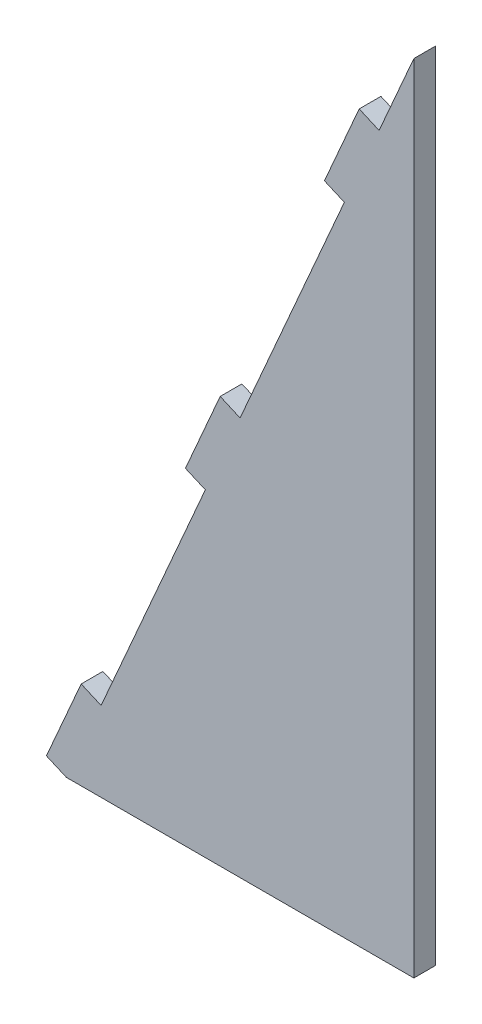
ISO-10303-21;
HEADER;
FILE_DESCRIPTION(('STEP AP214'),'2;1');
FILE_NAME('part.step','',(''),(''),'','','');
FILE_SCHEMA(('AUTOMOTIVE_DESIGN { 1 0 10303 214 1 1 1 1 }'));
ENDSEC;
DATA;
#1=APPLICATION_CONTEXT('core data for automotive mechanical design processes');
#2=APPLICATION_PROTOCOL_DEFINITION('international standard','automotive_design',2000,#1);
#3=PRODUCT_CONTEXT('',#1,'mechanical');
#4=PRODUCT('Part','Part','',(#3));
#5=PRODUCT_RELATED_PRODUCT_CATEGORY('part','',(#4));
#6=PRODUCT_DEFINITION_FORMATION('','',#4);
#7=PRODUCT_DEFINITION_CONTEXT('part definition',#1,'design');
#8=PRODUCT_DEFINITION('design','',#6,#7);
#9=PRODUCT_DEFINITION_SHAPE('','',#8);
#10=(LENGTH_UNIT() NAMED_UNIT(*) SI_UNIT(.MILLI.,.METRE.));
#11=(NAMED_UNIT(*) PLANE_ANGLE_UNIT() SI_UNIT($,.RADIAN.));
#12=(NAMED_UNIT(*) SI_UNIT($,.STERADIAN.) SOLID_ANGLE_UNIT());
#13=UNCERTAINTY_MEASURE_WITH_UNIT(LENGTH_MEASURE(1.E-05),#10,'distance_accuracy_value','');
#14=(GEOMETRIC_REPRESENTATION_CONTEXT(3) GLOBAL_UNCERTAINTY_ASSIGNED_CONTEXT((#13)) GLOBAL_UNIT_ASSIGNED_CONTEXT((#10,
#11,#12)) REPRESENTATION_CONTEXT('',''));
#15=CARTESIAN_POINT('',(0.,0.,0.));
#16=DIRECTION('',(0.,0.,1.));
#17=DIRECTION('',(1.,0.,0.));
#18=AXIS2_PLACEMENT_3D('',#15,#16,#17);
#19=CARTESIAN_POINT('',(50.8000000000001,116.397422651878,3.17499999999998));
#20=DIRECTION('',(0.916515138991169,-0.4,0.));
#21=DIRECTION('',(0.400000000000001,0.916515138991168,0.));
#22=AXIS2_PLACEMENT_3D('',#19,#20,#21);
#23=PLANE('',#22);
#24=DIRECTION('',(0.,0.,1.));
#25=VECTOR('',#24,1.);
#26=CARTESIAN_POINT('',(40.6400000000001,93.1179381215027,0.));
#27=LINE('',#26,#25);
#28=CARTESIAN_POINT('',(40.6400000000001,93.1179381215027,0.));
#29=VERTEX_POINT('',#28);
#30=CARTESIAN_POINT('',(40.6400000000001,93.1179381215027,3.17499999999998));
#31=VERTEX_POINT('',#30);
#32=EDGE_CURVE('E244',#29,#31,#27,.T.);
#33=ORIENTED_EDGE('',*,*,#32,.F.);
#34=DIRECTION('',(-0.400000000000001,-0.916515138991169,0.));
#35=VECTOR('',#34,1.);
#36=CARTESIAN_POINT('',(50.8000000000001,116.397422651878,0.));
#37=LINE('',#36,#35);
#38=CARTESIAN_POINT('',(25.4,58.1987113259392,0.));
#39=VERTEX_POINT('',#38);
#40=EDGE_CURVE('E156',#29,#39,#37,.T.);
#41=ORIENTED_EDGE('',*,*,#40,.T.);
#42=DIRECTION('',(0.,0.,-1.));
#43=VECTOR('',#42,1.);
#44=CARTESIAN_POINT('',(25.4000000000001,58.1987113259392,0.));
#45=LINE('',#44,#43);
#46=CARTESIAN_POINT('',(25.4,58.1987113259392,3.17499999999999));
#47=VERTEX_POINT('',#46);
#48=EDGE_CURVE('E160',#47,#39,#45,.T.);
#49=ORIENTED_EDGE('',*,*,#48,.F.);
#50=DIRECTION('',(-0.400000000000001,-0.916515138991169,0.));
#51=VECTOR('',#50,1.);
#52=CARTESIAN_POINT('',(50.8000000000001,116.397422651878,3.17499999999998));
#53=LINE('',#52,#51);
#54=EDGE_CURVE('E46',#31,#47,#53,.T.);
#55=ORIENTED_EDGE('',*,*,#54,.F.);
#56=EDGE_LOOP('',(#33,#41,#49,#55));
#57=FACE_BOUND('',#56,.T.);
#58=ADVANCED_FACE('F31',(#57),#23,.F.);
#59=DIRECTION('',(0.,0.,-1.));
#60=VECTOR('',#59,1.);
#61=CARTESIAN_POINT('',(45.7200000000001,104.757680386691,0.));
#62=LINE('',#61,#60);
#63=CARTESIAN_POINT('',(45.7200000000001,104.757680386691,3.17499999999998));
#64=VERTEX_POINT('',#63);
#65=CARTESIAN_POINT('',(45.7200000000001,104.757680386691,0.));
#66=VERTEX_POINT('',#65);
#67=EDGE_CURVE('E54',#64,#66,#62,.T.);
#68=ORIENTED_EDGE('',*,*,#67,.F.);
#69=CARTESIAN_POINT('',(50.8000000000001,116.397422651878,3.17499999999998));
#70=VERTEX_POINT('',#69);
#71=EDGE_CURVE('E213',#70,#64,#53,.T.);
#72=ORIENTED_EDGE('',*,*,#71,.F.);
#73=DIRECTION('',(0.,0.,-1.));
#74=VECTOR('',#73,1.);
#75=CARTESIAN_POINT('',(50.8000000000001,116.397422651878,3.17499999999998));
#76=LINE('',#75,#74);
#77=CARTESIAN_POINT('',(50.8000000000001,116.397422651878,0.));
#78=VERTEX_POINT('',#77);
#79=EDGE_CURVE('E220',#70,#78,#76,.T.);
#80=ORIENTED_EDGE('',*,*,#79,.T.);
#81=EDGE_CURVE('E221',#78,#66,#37,.T.);
#82=ORIENTED_EDGE('',*,*,#81,.T.);
#83=EDGE_LOOP('',(#68,#72,#80,#82));
#84=FACE_BOUND('',#83,.T.);
#85=ADVANCED_FACE('F239',(#84),#23,.F.);
#86=DIRECTION('',(0.,0.,1.));
#87=VECTOR('',#86,1.);
#88=CARTESIAN_POINT('',(20.32,46.5589690607513,0.));
#89=LINE('',#88,#87);
#90=CARTESIAN_POINT('',(20.32,46.5589690607513,0.));
#91=VERTEX_POINT('',#90);
#92=CARTESIAN_POINT('',(20.32,46.5589690607513,3.17499999999999));
#93=VERTEX_POINT('',#92);
#94=EDGE_CURVE('E157',#91,#93,#89,.T.);
#95=ORIENTED_EDGE('',*,*,#94,.F.);
#96=CARTESIAN_POINT('',(5.07999999999999,11.6397422651878,0.));
#97=VERTEX_POINT('',#96);
#98=EDGE_CURVE('E212',#91,#97,#37,.T.);
#99=ORIENTED_EDGE('',*,*,#98,.T.);
#100=DIRECTION('',(0.,0.,-1.));
#101=VECTOR('',#100,1.);
#102=CARTESIAN_POINT('',(5.08,11.6397422651878,0.));
#103=LINE('',#102,#101);
#104=CARTESIAN_POINT('',(5.07999999999999,11.6397422651878,3.17500000000001));
#105=VERTEX_POINT('',#104);
#106=EDGE_CURVE('E188',#105,#97,#103,.T.);
#107=ORIENTED_EDGE('',*,*,#106,.F.);
#108=EDGE_CURVE('E216',#93,#105,#53,.T.);
#109=ORIENTED_EDGE('',*,*,#108,.F.);
#110=EDGE_LOOP('',(#95,#99,#107,#109));
#111=FACE_BOUND('',#110,.T.);
#112=ADVANCED_FACE('F33',(#111),#23,.F.);
#113=CARTESIAN_POINT('',(0.,0.,3.175));
#114=DIRECTION('',(0.,1.,0.));
#115=DIRECTION('',(0.,0.,1.));
#116=AXIS2_PLACEMENT_3D('',#113,#114,#115);
#117=PLANE('',#116);
#118=DIRECTION('',(1.,0.,0.));
#119=VECTOR('',#118,1.);
#120=CARTESIAN_POINT('',(0.,0.,0.));
#121=LINE('',#120,#119);
#122=CARTESIAN_POINT('',(0.,0.,0.));
#123=VERTEX_POINT('',#122);
#124=CARTESIAN_POINT('',(50.8,0.,0.));
#125=VERTEX_POINT('',#124);
#126=EDGE_CURVE('E223',#123,#125,#121,.T.);
#127=ORIENTED_EDGE('',*,*,#126,.T.);
#128=DIRECTION('',(0.,0.,-1.));
#129=VECTOR('',#128,1.);
#130=CARTESIAN_POINT('',(50.8,0.,3.17500000000001));
#131=LINE('',#130,#129);
#132=CARTESIAN_POINT('',(50.8,0.,3.17500000000001));
#133=VERTEX_POINT('',#132);
#134=EDGE_CURVE('E39',#133,#125,#131,.T.);
#135=ORIENTED_EDGE('',*,*,#134,.F.);
#136=DIRECTION('',(1.,0.,0.));
#137=VECTOR('',#136,1.);
#138=CARTESIAN_POINT('',(0.,0.,3.175));
#139=LINE('',#138,#137);
#140=CARTESIAN_POINT('',(0.,0.,3.175));
#141=VERTEX_POINT('',#140);
#142=EDGE_CURVE('E215',#141,#133,#139,.T.);
#143=ORIENTED_EDGE('',*,*,#142,.F.);
#144=DIRECTION('',(0.,0.,-1.));
#145=VECTOR('',#144,1.);
#146=CARTESIAN_POINT('',(0.,0.,3.175));
#147=LINE('',#146,#145);
#148=EDGE_CURVE('E11',#141,#123,#147,.T.);
#149=ORIENTED_EDGE('',*,*,#148,.T.);
#150=EDGE_LOOP('',(#127,#135,#143,#149));
#151=FACE_BOUND('',#150,.T.);
#152=ADVANCED_FACE('F255',(#151),#117,.F.);
#153=CARTESIAN_POINT('',(50.8,0.,3.17500000000001));
#154=DIRECTION('',(-1.,0.,0.));
#155=DIRECTION('',(0.,0.,1.));
#156=AXIS2_PLACEMENT_3D('',#153,#154,#155);
#157=PLANE('',#156);
#158=DIRECTION('',(0.,1.,0.));
#159=VECTOR('',#158,1.);
#160=CARTESIAN_POINT('',(50.8,0.,0.));
#161=LINE('',#160,#159);
#162=EDGE_CURVE('E225',#125,#78,#161,.T.);
#163=ORIENTED_EDGE('',*,*,#162,.T.);
#164=ORIENTED_EDGE('',*,*,#79,.F.);
#165=DIRECTION('',(0.,1.,0.));
#166=VECTOR('',#165,1.);
#167=CARTESIAN_POINT('',(50.8,0.,3.17500000000001));
#168=LINE('',#167,#166);
#169=EDGE_CURVE('E218',#133,#70,#168,.T.);
#170=ORIENTED_EDGE('',*,*,#169,.F.);
#171=ORIENTED_EDGE('',*,*,#134,.T.);
#172=EDGE_LOOP('',(#163,#164,#170,#171));
#173=FACE_BOUND('',#172,.T.);
#174=ADVANCED_FACE('F233',(#173),#157,.F.);
#175=CARTESIAN_POINT('',(0.,0.,3.175));
#176=DIRECTION('',(0.,0.,1.));
#177=DIRECTION('',(1.,0.,0.));
#178=AXIS2_PLACEMENT_3D('',#175,#176,#177);
#179=PLANE('',#178);
#180=ORIENTED_EDGE('',*,*,#71,.T.);
#181=DIRECTION('',(0.916515138991169,-0.4,0.));
#182=VECTOR('',#181,1.);
#183=CARTESIAN_POINT('',(42.8100644337031,106.027680386691,3.17499999999998));
#184=LINE('',#183,#182);
#185=CARTESIAN_POINT('',(42.8100644337031,106.027680386691,3.17499999999998));
#186=VERTEX_POINT('',#185);
#187=EDGE_CURVE('E162',#186,#64,#184,.T.);
#188=ORIENTED_EDGE('',*,*,#187,.F.);
#189=DIRECTION('',(0.400000000000001,0.916515138991169,0.));
#190=VECTOR('',#189,1.);
#191=CARTESIAN_POINT('',(37.7300644337031,94.3879381215027,3.17499999999998));
#192=LINE('',#191,#190);
#193=CARTESIAN_POINT('',(37.7300644337031,94.3879381215027,3.17499999999998));
#194=VERTEX_POINT('',#193);
#195=EDGE_CURVE('E142',#194,#186,#192,.T.);
#196=ORIENTED_EDGE('',*,*,#195,.F.);
#197=DIRECTION('',(0.916515138991169,-0.4,0.));
#198=VECTOR('',#197,1.);
#199=CARTESIAN_POINT('',(37.7300644337031,94.3879381215027,3.17499999999998));
#200=LINE('',#199,#198);
#201=EDGE_CURVE('E139',#194,#31,#200,.T.);
#202=ORIENTED_EDGE('',*,*,#201,.T.);
#203=ORIENTED_EDGE('',*,*,#54,.T.);
#204=DIRECTION('',(0.916515138991169,-0.4,0.));
#205=VECTOR('',#204,1.);
#206=CARTESIAN_POINT('',(22.4900644337031,59.4687113259392,3.17499999999999));
#207=LINE('',#206,#205);
#208=CARTESIAN_POINT('',(22.4900644337031,59.4687113259392,3.17499999999999));
#209=VERTEX_POINT('',#208);
#210=EDGE_CURVE('E179',#209,#47,#207,.T.);
#211=ORIENTED_EDGE('',*,*,#210,.F.);
#212=DIRECTION('',(0.400000000000001,0.916515138991169,0.));
#213=VECTOR('',#212,1.);
#214=CARTESIAN_POINT('',(17.4100644337031,47.8289690607513,3.17499999999999));
#215=LINE('',#214,#213);
#216=CARTESIAN_POINT('',(17.4100644337031,47.8289690607513,3.17499999999999));
#217=VERTEX_POINT('',#216);
#218=EDGE_CURVE('E171',#217,#209,#215,.T.);
#219=ORIENTED_EDGE('',*,*,#218,.F.);
#220=DIRECTION('',(0.916515138991169,-0.4,0.));
#221=VECTOR('',#220,1.);
#222=CARTESIAN_POINT('',(17.4100644337031,47.8289690607513,3.17499999999999));
#223=LINE('',#222,#221);
#224=EDGE_CURVE('E182',#217,#93,#223,.T.);
#225=ORIENTED_EDGE('',*,*,#224,.T.);
#226=ORIENTED_EDGE('',*,*,#108,.T.);
#227=DIRECTION('',(0.916515138991169,-0.4,0.));
#228=VECTOR('',#227,1.);
#229=CARTESIAN_POINT('',(2.17006443370305,12.9097422651878,3.17500000000001));
#230=LINE('',#229,#228);
#231=CARTESIAN_POINT('',(2.17006443370305,12.9097422651878,3.17500000000001));
#232=VERTEX_POINT('',#231);
#233=EDGE_CURVE('E203',#232,#105,#230,.T.);
#234=ORIENTED_EDGE('',*,*,#233,.F.);
#235=DIRECTION('',(0.400000000000001,0.916515138991169,0.));
#236=VECTOR('',#235,1.);
#237=CARTESIAN_POINT('',(-2.90993556629697,1.27,3.175));
#238=LINE('',#237,#236);
#239=CARTESIAN_POINT('',(-2.90993556629697,1.27,3.175));
#240=VERTEX_POINT('',#239);
#241=EDGE_CURVE('E194',#240,#232,#238,.T.);
#242=ORIENTED_EDGE('',*,*,#241,.F.);
#243=DIRECTION('',(0.916515138991169,-0.4,0.));
#244=VECTOR('',#243,1.);
#245=CARTESIAN_POINT('',(-2.90993556629697,1.27,3.175));
#246=LINE('',#245,#244);
#247=EDGE_CURVE('E206',#240,#141,#246,.T.);
#248=ORIENTED_EDGE('',*,*,#247,.T.);
#249=ORIENTED_EDGE('',*,*,#142,.T.);
#250=ORIENTED_EDGE('',*,*,#169,.T.);
#251=EDGE_LOOP('',(#180,#188,#196,#202,#203,#211,#219,#225,#226,#234,#242,#248,#249,#250));
#252=FACE_BOUND('',#251,.T.);
#253=ADVANCED_FACE('F251',(#252),#179,.T.);
#254=CARTESIAN_POINT('',(0.,0.,0.));
#255=DIRECTION('',(0.,0.,1.));
#256=DIRECTION('',(1.,0.,0.));
#257=AXIS2_PLACEMENT_3D('',#254,#255,#256);
#258=PLANE('',#257);
#259=ORIENTED_EDGE('',*,*,#81,.F.);
#260=ORIENTED_EDGE('',*,*,#162,.F.);
#261=ORIENTED_EDGE('',*,*,#126,.F.);
#262=DIRECTION('',(0.916515138991169,-0.4,0.));
#263=VECTOR('',#262,1.);
#264=CARTESIAN_POINT('',(-2.90993556629697,1.27,0.));
#265=LINE('',#264,#263);
#266=CARTESIAN_POINT('',(-2.90993556629697,1.27,0.));
#267=VERTEX_POINT('',#266);
#268=EDGE_CURVE('E209',#267,#123,#265,.T.);
#269=ORIENTED_EDGE('',*,*,#268,.F.);
#270=DIRECTION('',(-0.400000000000001,-0.916515138991168,0.));
#271=VECTOR('',#270,1.);
#272=CARTESIAN_POINT('',(-2.90993556629697,1.27,0.));
#273=LINE('',#272,#271);
#274=CARTESIAN_POINT('',(2.17006443370305,12.9097422651878,0.));
#275=VERTEX_POINT('',#274);
#276=EDGE_CURVE('E189',#275,#267,#273,.T.);
#277=ORIENTED_EDGE('',*,*,#276,.F.);
#278=DIRECTION('',(0.916515138991169,-0.4,0.));
#279=VECTOR('',#278,1.);
#280=CARTESIAN_POINT('',(2.17006443370305,12.9097422651878,0.));
#281=LINE('',#280,#279);
#282=EDGE_CURVE('E198',#275,#97,#281,.T.);
#283=ORIENTED_EDGE('',*,*,#282,.T.);
#284=ORIENTED_EDGE('',*,*,#98,.F.);
#285=DIRECTION('',(0.916515138991169,-0.4,0.));
#286=VECTOR('',#285,1.);
#287=CARTESIAN_POINT('',(17.4100644337031,47.8289690607513,0.));
#288=LINE('',#287,#286);
#289=CARTESIAN_POINT('',(17.4100644337031,47.8289690607513,0.));
#290=VERTEX_POINT('',#289);
#291=EDGE_CURVE('E185',#290,#91,#288,.T.);
#292=ORIENTED_EDGE('',*,*,#291,.F.);
#293=DIRECTION('',(-0.400000000000001,-0.916515138991168,0.));
#294=VECTOR('',#293,1.);
#295=CARTESIAN_POINT('',(17.4100644337031,47.8289690607513,0.));
#296=LINE('',#295,#294);
#297=CARTESIAN_POINT('',(22.4900644337031,59.4687113259392,0.));
#298=VERTEX_POINT('',#297);
#299=EDGE_CURVE('E166',#298,#290,#296,.T.);
#300=ORIENTED_EDGE('',*,*,#299,.F.);
#301=DIRECTION('',(0.916515138991169,-0.4,0.));
#302=VECTOR('',#301,1.);
#303=CARTESIAN_POINT('',(22.4900644337031,59.4687113259392,0.));
#304=LINE('',#303,#302);
#305=EDGE_CURVE('E174',#298,#39,#304,.T.);
#306=ORIENTED_EDGE('',*,*,#305,.T.);
#307=ORIENTED_EDGE('',*,*,#40,.F.);
#308=DIRECTION('',(0.916515138991169,-0.4,0.));
#309=VECTOR('',#308,1.);
#310=CARTESIAN_POINT('',(37.7300644337031,94.3879381215027,0.));
#311=LINE('',#310,#309);
#312=CARTESIAN_POINT('',(37.7300644337031,94.3879381215027,0.));
#313=VERTEX_POINT('',#312);
#314=EDGE_CURVE('E137',#313,#29,#311,.T.);
#315=ORIENTED_EDGE('',*,*,#314,.F.);
#316=DIRECTION('',(-0.400000000000001,-0.916515138991168,0.));
#317=VECTOR('',#316,1.);
#318=CARTESIAN_POINT('',(37.7300644337031,94.3879381215027,0.));
#319=LINE('',#318,#317);
#320=CARTESIAN_POINT('',(42.8100644337031,106.027680386691,0.));
#321=VERTEX_POINT('',#320);
#322=EDGE_CURVE('E143',#321,#313,#319,.T.);
#323=ORIENTED_EDGE('',*,*,#322,.F.);
#324=DIRECTION('',(0.916515138991169,-0.4,0.));
#325=VECTOR('',#324,1.);
#326=CARTESIAN_POINT('',(42.8100644337031,106.027680386691,0.));
#327=LINE('',#326,#325);
#328=EDGE_CURVE('E238',#321,#66,#327,.T.);
#329=ORIENTED_EDGE('',*,*,#328,.T.);
#330=EDGE_LOOP('',(#259,#260,#261,#269,#277,#283,#284,#292,#300,#306,#307,#315,#323,#329));
#331=FACE_BOUND('',#330,.T.);
#332=ADVANCED_FACE('F154',(#331),#258,.F.);
#333=CARTESIAN_POINT('',(-2.90993556629697,1.27,0.));
#334=DIRECTION('',(0.400000000000001,0.916515138991168,0.));
#335=DIRECTION('',(-0.916515138991169,0.4,0.));
#336=AXIS2_PLACEMENT_3D('',#333,#334,#335);
#337=PLANE('',#336);
#338=ORIENTED_EDGE('',*,*,#148,.F.);
#339=ORIENTED_EDGE('',*,*,#247,.F.);
#340=DIRECTION('',(0.,0.,1.));
#341=VECTOR('',#340,1.);
#342=CARTESIAN_POINT('',(-2.90993556629697,1.27,0.));
#343=LINE('',#342,#341);
#344=EDGE_CURVE('E192',#267,#240,#343,.T.);
#345=ORIENTED_EDGE('',*,*,#344,.F.);
#346=ORIENTED_EDGE('',*,*,#268,.T.);
#347=EDGE_LOOP('',(#338,#339,#345,#346));
#348=FACE_BOUND('',#347,.T.);
#349=ADVANCED_FACE('F257',(#348),#337,.F.);
#350=CARTESIAN_POINT('',(2.17006443370305,12.9097422651878,0.));
#351=DIRECTION('',(-0.400000000000001,-0.916515138991168,0.));
#352=DIRECTION('',(0.916515138991169,-0.4,0.));
#353=AXIS2_PLACEMENT_3D('',#350,#351,#352);
#354=PLANE('',#353);
#355=ORIENTED_EDGE('',*,*,#106,.T.);
#356=ORIENTED_EDGE('',*,*,#282,.F.);
#357=DIRECTION('',(0.,0.,-1.));
#358=VECTOR('',#357,1.);
#359=CARTESIAN_POINT('',(2.17006443370305,12.9097422651878,0.));
#360=LINE('',#359,#358);
#361=EDGE_CURVE('E196',#232,#275,#360,.T.);
#362=ORIENTED_EDGE('',*,*,#361,.F.);
#363=ORIENTED_EDGE('',*,*,#233,.T.);
#364=EDGE_LOOP('',(#355,#356,#362,#363));
#365=FACE_BOUND('',#364,.T.);
#366=ADVANCED_FACE('F265',(#365),#354,.F.);
#367=CARTESIAN_POINT('',(2.17006443370305,12.9097422651878,0.));
#368=DIRECTION('',(0.916515138991169,-0.4,0.));
#369=DIRECTION('',(0.400000000000001,0.916515138991168,0.));
#370=AXIS2_PLACEMENT_3D('',#367,#368,#369);
#371=PLANE('',#370);
#372=ORIENTED_EDGE('',*,*,#276,.T.);
#373=ORIENTED_EDGE('',*,*,#344,.T.);
#374=ORIENTED_EDGE('',*,*,#241,.T.);
#375=ORIENTED_EDGE('',*,*,#361,.T.);
#376=EDGE_LOOP('',(#372,#373,#374,#375));
#377=FACE_BOUND('',#376,.T.);
#378=ADVANCED_FACE('F261',(#377),#371,.F.);
#379=CARTESIAN_POINT('',(17.4100644337031,47.8289690607513,0.));
#380=DIRECTION('',(0.400000000000001,0.916515138991168,0.));
#381=DIRECTION('',(-0.916515138991169,0.4,0.));
#382=AXIS2_PLACEMENT_3D('',#379,#380,#381);
#383=PLANE('',#382);
#384=ORIENTED_EDGE('',*,*,#94,.T.);
#385=ORIENTED_EDGE('',*,*,#224,.F.);
#386=DIRECTION('',(0.,0.,1.));
#387=VECTOR('',#386,1.);
#388=CARTESIAN_POINT('',(17.4100644337031,47.8289690607513,0.));
#389=LINE('',#388,#387);
#390=EDGE_CURVE('E169',#290,#217,#389,.T.);
#391=ORIENTED_EDGE('',*,*,#390,.F.);
#392=ORIENTED_EDGE('',*,*,#291,.T.);
#393=EDGE_LOOP('',(#384,#385,#391,#392));
#394=FACE_BOUND('',#393,.T.);
#395=ADVANCED_FACE('F281',(#394),#383,.F.);
#396=CARTESIAN_POINT('',(22.4900644337031,59.4687113259392,0.));
#397=DIRECTION('',(-0.400000000000001,-0.916515138991168,0.));
#398=DIRECTION('',(0.916515138991169,-0.4,0.));
#399=AXIS2_PLACEMENT_3D('',#396,#397,#398);
#400=PLANE('',#399);
#401=ORIENTED_EDGE('',*,*,#48,.T.);
#402=ORIENTED_EDGE('',*,*,#305,.F.);
#403=DIRECTION('',(0.,0.,-1.));
#404=VECTOR('',#403,1.);
#405=CARTESIAN_POINT('',(22.4900644337031,59.4687113259392,0.));
#406=LINE('',#405,#404);
#407=EDGE_CURVE('E173',#209,#298,#406,.T.);
#408=ORIENTED_EDGE('',*,*,#407,.F.);
#409=ORIENTED_EDGE('',*,*,#210,.T.);
#410=EDGE_LOOP('',(#401,#402,#408,#409));
#411=FACE_BOUND('',#410,.T.);
#412=ADVANCED_FACE('F272',(#411),#400,.F.);
#413=CARTESIAN_POINT('',(22.4900644337031,59.4687113259392,0.));
#414=DIRECTION('',(0.916515138991169,-0.4,0.));
#415=DIRECTION('',(0.400000000000001,0.916515138991168,0.));
#416=AXIS2_PLACEMENT_3D('',#413,#414,#415);
#417=PLANE('',#416);
#418=ORIENTED_EDGE('',*,*,#299,.T.);
#419=ORIENTED_EDGE('',*,*,#390,.T.);
#420=ORIENTED_EDGE('',*,*,#218,.T.);
#421=ORIENTED_EDGE('',*,*,#407,.T.);
#422=EDGE_LOOP('',(#418,#419,#420,#421));
#423=FACE_BOUND('',#422,.T.);
#424=ADVANCED_FACE('F277',(#423),#417,.F.);
#425=CARTESIAN_POINT('',(37.7300644337031,94.3879381215027,0.));
#426=DIRECTION('',(0.400000000000001,0.916515138991168,0.));
#427=DIRECTION('',(-0.916515138991169,0.4,0.));
#428=AXIS2_PLACEMENT_3D('',#425,#426,#427);
#429=PLANE('',#428);
#430=ORIENTED_EDGE('',*,*,#32,.T.);
#431=ORIENTED_EDGE('',*,*,#201,.F.);
#432=DIRECTION('',(0.,0.,1.));
#433=VECTOR('',#432,1.);
#434=CARTESIAN_POINT('',(37.7300644337031,94.3879381215027,0.));
#435=LINE('',#434,#433);
#436=EDGE_CURVE('E133',#313,#194,#435,.T.);
#437=ORIENTED_EDGE('',*,*,#436,.F.);
#438=ORIENTED_EDGE('',*,*,#314,.T.);
#439=EDGE_LOOP('',(#430,#431,#437,#438));
#440=FACE_BOUND('',#439,.T.);
#441=ADVANCED_FACE('F135',(#440),#429,.F.);
#442=CARTESIAN_POINT('',(42.8100644337031,106.027680386691,0.));
#443=DIRECTION('',(-0.400000000000001,-0.916515138991168,0.));
#444=DIRECTION('',(0.916515138991169,-0.4,0.));
#445=AXIS2_PLACEMENT_3D('',#442,#443,#444);
#446=PLANE('',#445);
#447=ORIENTED_EDGE('',*,*,#67,.T.);
#448=ORIENTED_EDGE('',*,*,#328,.F.);
#449=DIRECTION('',(0.,0.,-1.));
#450=VECTOR('',#449,1.);
#451=CARTESIAN_POINT('',(42.8100644337031,106.027680386691,0.));
#452=LINE('',#451,#450);
#453=EDGE_CURVE('E148',#186,#321,#452,.T.);
#454=ORIENTED_EDGE('',*,*,#453,.F.);
#455=ORIENTED_EDGE('',*,*,#187,.T.);
#456=EDGE_LOOP('',(#447,#448,#454,#455));
#457=FACE_BOUND('',#456,.T.);
#458=ADVANCED_FACE('F242',(#457),#446,.F.);
#459=CARTESIAN_POINT('',(42.8100644337031,106.027680386691,0.));
#460=DIRECTION('',(0.916515138991169,-0.4,0.));
#461=DIRECTION('',(0.400000000000001,0.916515138991168,0.));
#462=AXIS2_PLACEMENT_3D('',#459,#460,#461);
#463=PLANE('',#462);
#464=ORIENTED_EDGE('',*,*,#322,.T.);
#465=ORIENTED_EDGE('',*,*,#436,.T.);
#466=ORIENTED_EDGE('',*,*,#195,.T.);
#467=ORIENTED_EDGE('',*,*,#453,.T.);
#468=EDGE_LOOP('',(#464,#465,#466,#467));
#469=FACE_BOUND('',#468,.T.);
#470=ADVANCED_FACE('F146',(#469),#463,.F.);
#471=CLOSED_SHELL('',(#58,#85,#112,#152,#174,#253,#332,#349,#366,#378,#395,#412,#424,#441,#458,#470));
#472=MANIFOLD_SOLID_BREP('B2',#471);
#473=ADVANCED_BREP_SHAPE_REPRESENTATION('',(#18,#472),#14);
#474=SHAPE_DEFINITION_REPRESENTATION(#9,#473);
ENDSEC;
END-ISO-10303-21;
